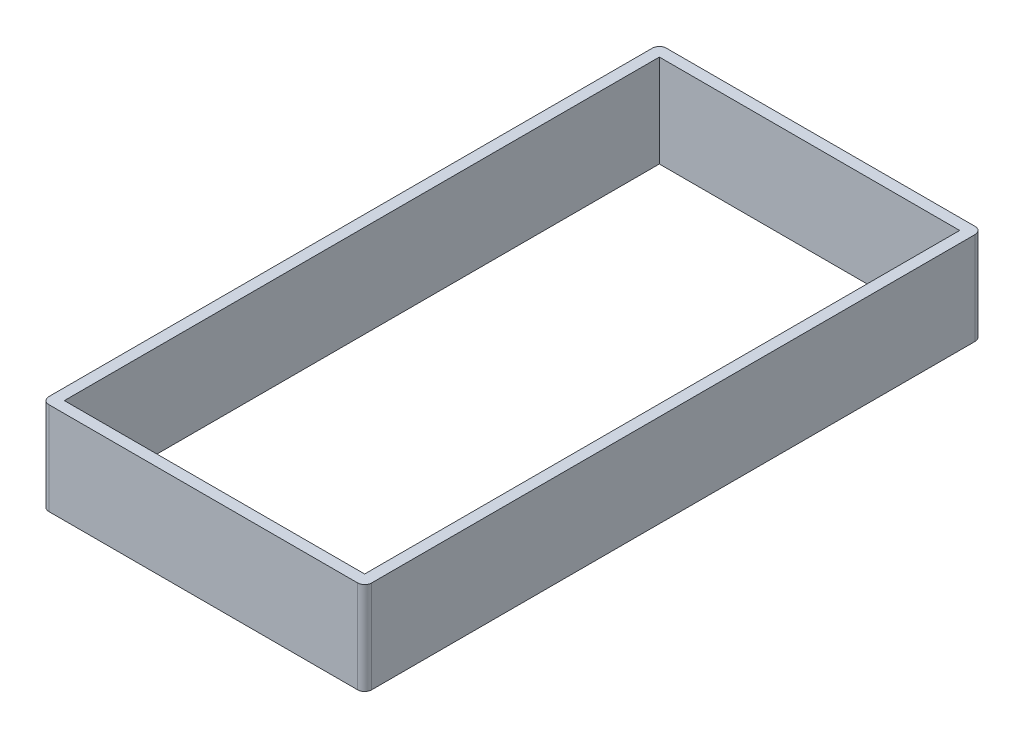
ISO-10303-21;
HEADER;
FILE_DESCRIPTION(('STEP AP214'),'2;1');
FILE_NAME('part.step','',(''),(''),'','','');
FILE_SCHEMA(('AUTOMOTIVE_DESIGN { 1 0 10303 214 1 1 1 1 }'));
ENDSEC;
DATA;
#1=APPLICATION_CONTEXT('core data for automotive mechanical design processes');
#2=APPLICATION_PROTOCOL_DEFINITION('international standard','automotive_design',2000,#1);
#3=PRODUCT_CONTEXT('',#1,'mechanical');
#4=PRODUCT('Part','Part','',(#3));
#5=PRODUCT_RELATED_PRODUCT_CATEGORY('part','',(#4));
#6=PRODUCT_DEFINITION_FORMATION('','',#4);
#7=PRODUCT_DEFINITION_CONTEXT('part definition',#1,'design');
#8=PRODUCT_DEFINITION('design','',#6,#7);
#9=PRODUCT_DEFINITION_SHAPE('','',#8);
#10=(LENGTH_UNIT() NAMED_UNIT(*) SI_UNIT(.MILLI.,.METRE.));
#11=(NAMED_UNIT(*) PLANE_ANGLE_UNIT() SI_UNIT($,.RADIAN.));
#12=(NAMED_UNIT(*) SI_UNIT($,.STERADIAN.) SOLID_ANGLE_UNIT());
#13=UNCERTAINTY_MEASURE_WITH_UNIT(LENGTH_MEASURE(1.E-05),#10,'distance_accuracy_value','');
#14=(GEOMETRIC_REPRESENTATION_CONTEXT(3) GLOBAL_UNCERTAINTY_ASSIGNED_CONTEXT((#13)) GLOBAL_UNIT_ASSIGNED_CONTEXT((#10,
#11,#12)) REPRESENTATION_CONTEXT('',''));
#15=CARTESIAN_POINT('',(0.,0.,0.));
#16=DIRECTION('',(0.,0.,1.));
#17=DIRECTION('',(1.,0.,0.));
#18=AXIS2_PLACEMENT_3D('',#15,#16,#17);
#19=CARTESIAN_POINT('',(11.5,3.3,-22.));
#20=DIRECTION('',(-1.,0.,0.));
#21=DIRECTION('',(0.,0.,1.));
#22=AXIS2_PLACEMENT_3D('',#19,#20,#21);
#23=PLANE('',#22);
#24=DIRECTION('',(0.,0.,-1.));
#25=VECTOR('',#24,1.);
#26=CARTESIAN_POINT('',(11.5,-3.3,-22.));
#27=LINE('',#26,#25);
#28=CARTESIAN_POINT('',(11.5,-3.3,21.5));
#29=VERTEX_POINT('',#28);
#30=CARTESIAN_POINT('',(11.5,-3.3,-21.5));
#31=VERTEX_POINT('',#30);
#32=EDGE_CURVE('E160',#29,#31,#27,.T.);
#33=ORIENTED_EDGE('',*,*,#32,.T.);
#34=DIRECTION('',(0.,-1.,0.));
#35=VECTOR('',#34,1.);
#36=CARTESIAN_POINT('',(11.5,3.3,-21.5));
#37=LINE('',#36,#35);
#38=CARTESIAN_POINT('',(11.5,3.3,-21.5));
#39=VERTEX_POINT('',#38);
#40=EDGE_CURVE('E218',#31,#39,#37,.F.);
#41=ORIENTED_EDGE('',*,*,#40,.T.);
#42=DIRECTION('',(0.,0.,-1.));
#43=VECTOR('',#42,1.);
#44=CARTESIAN_POINT('',(11.5,3.3,-22.));
#45=LINE('',#44,#43);
#46=CARTESIAN_POINT('',(11.5,3.3,21.5));
#47=VERTEX_POINT('',#46);
#48=EDGE_CURVE('E164',#47,#39,#45,.T.);
#49=ORIENTED_EDGE('',*,*,#48,.F.);
#50=DIRECTION('',(0.,-1.,0.));
#51=VECTOR('',#50,1.);
#52=CARTESIAN_POINT('',(11.5,3.3,21.5));
#53=LINE('',#52,#51);
#54=EDGE_CURVE('E215',#47,#29,#53,.T.);
#55=ORIENTED_EDGE('',*,*,#54,.T.);
#56=EDGE_LOOP('',(#33,#41,#49,#55));
#57=FACE_BOUND('',#56,.T.);
#58=ADVANCED_FACE('F37',(#57),#23,.F.);
#59=CARTESIAN_POINT('',(-11.5,3.3,-22.));
#60=DIRECTION('',(0.,0.,1.));
#61=DIRECTION('',(1.,0.,0.));
#62=AXIS2_PLACEMENT_3D('',#59,#60,#61);
#63=PLANE('',#62);
#64=DIRECTION('',(-1.,0.,0.));
#65=VECTOR('',#64,1.);
#66=CARTESIAN_POINT('',(-11.5,-3.3,-22.));
#67=LINE('',#66,#65);
#68=CARTESIAN_POINT('',(11.,-3.3,-22.));
#69=VERTEX_POINT('',#68);
#70=CARTESIAN_POINT('',(-11.,-3.3,-22.));
#71=VERTEX_POINT('',#70);
#72=EDGE_CURVE('E181',#69,#71,#67,.T.);
#73=ORIENTED_EDGE('',*,*,#72,.T.);
#74=DIRECTION('',(0.,-1.,0.));
#75=VECTOR('',#74,1.);
#76=CARTESIAN_POINT('',(-11.,3.3,-22.));
#77=LINE('',#76,#75);
#78=CARTESIAN_POINT('',(-11.,3.3,-22.));
#79=VERTEX_POINT('',#78);
#80=EDGE_CURVE('E205',#71,#79,#77,.F.);
#81=ORIENTED_EDGE('',*,*,#80,.T.);
#82=DIRECTION('',(-1.,0.,0.));
#83=VECTOR('',#82,1.);
#84=CARTESIAN_POINT('',(-11.5,3.3,-22.));
#85=LINE('',#84,#83);
#86=CARTESIAN_POINT('',(11.,3.3,-22.));
#87=VERTEX_POINT('',#86);
#88=EDGE_CURVE('E167',#87,#79,#85,.T.);
#89=ORIENTED_EDGE('',*,*,#88,.F.);
#90=DIRECTION('',(0.,-1.,0.));
#91=VECTOR('',#90,1.);
#92=CARTESIAN_POINT('',(11.,3.3,-22.));
#93=LINE('',#92,#91);
#94=EDGE_CURVE('E202',#87,#69,#93,.T.);
#95=ORIENTED_EDGE('',*,*,#94,.T.);
#96=EDGE_LOOP('',(#73,#81,#89,#95));
#97=FACE_BOUND('',#96,.T.);
#98=ADVANCED_FACE('F246',(#97),#63,.F.);
#99=CARTESIAN_POINT('',(-11.5,3.3,-22.));
#100=DIRECTION('',(1.,0.,0.));
#101=DIRECTION('',(0.,0.,-1.));
#102=AXIS2_PLACEMENT_3D('',#99,#100,#101);
#103=PLANE('',#102);
#104=DIRECTION('',(0.,0.,1.));
#105=VECTOR('',#104,1.);
#106=CARTESIAN_POINT('',(-11.5,3.3,-22.));
#107=LINE('',#106,#105);
#108=CARTESIAN_POINT('',(-11.5,3.3,-21.5));
#109=VERTEX_POINT('',#108);
#110=CARTESIAN_POINT('',(-11.5,3.3,21.5));
#111=VERTEX_POINT('',#110);
#112=EDGE_CURVE('E171',#109,#111,#107,.T.);
#113=ORIENTED_EDGE('',*,*,#112,.F.);
#114=DIRECTION('',(0.,-1.,0.));
#115=VECTOR('',#114,1.);
#116=CARTESIAN_POINT('',(-11.5,3.3,-21.5));
#117=LINE('',#116,#115);
#118=CARTESIAN_POINT('',(-11.5,-3.3,-21.5));
#119=VERTEX_POINT('',#118);
#120=EDGE_CURVE('E191',#109,#119,#117,.T.);
#121=ORIENTED_EDGE('',*,*,#120,.T.);
#122=DIRECTION('',(0.,0.,1.));
#123=VECTOR('',#122,1.);
#124=CARTESIAN_POINT('',(-11.5,-3.3,-22.));
#125=LINE('',#124,#123);
#126=CARTESIAN_POINT('',(-11.5,-3.3,21.5));
#127=VERTEX_POINT('',#126);
#128=EDGE_CURVE('E184',#119,#127,#125,.T.);
#129=ORIENTED_EDGE('',*,*,#128,.T.);
#130=DIRECTION('',(0.,-1.,0.));
#131=VECTOR('',#130,1.);
#132=CARTESIAN_POINT('',(-11.5,3.3,21.5));
#133=LINE('',#132,#131);
#134=EDGE_CURVE('E178',#127,#111,#133,.F.);
#135=ORIENTED_EDGE('',*,*,#134,.T.);
#136=EDGE_LOOP('',(#113,#121,#129,#135));
#137=FACE_BOUND('',#136,.T.);
#138=ADVANCED_FACE('F254',(#137),#103,.F.);
#139=CARTESIAN_POINT('',(-11.5,3.3,22.));
#140=DIRECTION('',(0.,0.,-1.));
#141=DIRECTION('',(-1.,0.,0.));
#142=AXIS2_PLACEMENT_3D('',#139,#140,#141);
#143=PLANE('',#142);
#144=DIRECTION('',(1.,0.,0.));
#145=VECTOR('',#144,1.);
#146=CARTESIAN_POINT('',(-11.5,-3.3,22.));
#147=LINE('',#146,#145);
#148=CARTESIAN_POINT('',(-11.,-3.3,22.));
#149=VERTEX_POINT('',#148);
#150=CARTESIAN_POINT('',(11.,-3.3,22.));
#151=VERTEX_POINT('',#150);
#152=EDGE_CURVE('E168',#149,#151,#147,.T.);
#153=ORIENTED_EDGE('',*,*,#152,.T.);
#154=DIRECTION('',(0.,-1.,0.));
#155=VECTOR('',#154,1.);
#156=CARTESIAN_POINT('',(11.,3.3,22.));
#157=LINE('',#156,#155);
#158=CARTESIAN_POINT('',(11.,3.3,22.));
#159=VERTEX_POINT('',#158);
#160=EDGE_CURVE('E11',#151,#159,#157,.F.);
#161=ORIENTED_EDGE('',*,*,#160,.T.);
#162=DIRECTION('',(1.,0.,0.));
#163=VECTOR('',#162,1.);
#164=CARTESIAN_POINT('',(-11.5,3.3,22.));
#165=LINE('',#164,#163);
#166=CARTESIAN_POINT('',(-11.,3.3,22.));
#167=VERTEX_POINT('',#166);
#168=EDGE_CURVE('E174',#167,#159,#165,.T.);
#169=ORIENTED_EDGE('',*,*,#168,.F.);
#170=DIRECTION('',(0.,-1.,0.));
#171=VECTOR('',#170,1.);
#172=CARTESIAN_POINT('',(-11.,3.3,22.));
#173=LINE('',#172,#171);
#174=EDGE_CURVE('E45',#167,#149,#173,.T.);
#175=ORIENTED_EDGE('',*,*,#174,.T.);
#176=EDGE_LOOP('',(#153,#161,#169,#175));
#177=FACE_BOUND('',#176,.T.);
#178=ADVANCED_FACE('F224',(#177),#143,.F.);
#179=CARTESIAN_POINT('',(0.,3.3,0.));
#180=DIRECTION('',(0.,1.,0.));
#181=DIRECTION('',(0.,0.,1.));
#182=AXIS2_PLACEMENT_3D('',#179,#180,#181);
#183=PLANE('',#182);
#184=DIRECTION('',(0.,0.,-1.));
#185=VECTOR('',#184,1.);
#186=CARTESIAN_POINT('',(10.7,3.3,21.2));
#187=LINE('',#186,#185);
#188=CARTESIAN_POINT('',(10.7,3.3,21.2));
#189=VERTEX_POINT('',#188);
#190=CARTESIAN_POINT('',(10.7,3.3,-21.2));
#191=VERTEX_POINT('',#190);
#192=EDGE_CURVE('E52',#189,#191,#187,.T.);
#193=ORIENTED_EDGE('',*,*,#192,.F.);
#194=DIRECTION('',(1.,0.,0.));
#195=VECTOR('',#194,1.);
#196=CARTESIAN_POINT('',(-10.7,3.3,21.2));
#197=LINE('',#196,#195);
#198=CARTESIAN_POINT('',(-10.7,3.3,21.2));
#199=VERTEX_POINT('',#198);
#200=EDGE_CURVE('E143',#199,#189,#197,.T.);
#201=ORIENTED_EDGE('',*,*,#200,.F.);
#202=DIRECTION('',(0.,0.,1.));
#203=VECTOR('',#202,1.);
#204=CARTESIAN_POINT('',(-10.7,3.3,-21.2));
#205=LINE('',#204,#203);
#206=CARTESIAN_POINT('',(-10.7,3.3,-21.2));
#207=VERTEX_POINT('',#206);
#208=EDGE_CURVE('E147',#207,#199,#205,.T.);
#209=ORIENTED_EDGE('',*,*,#208,.F.);
#210=DIRECTION('',(-1.,0.,0.));
#211=VECTOR('',#210,1.);
#212=CARTESIAN_POINT('',(10.7,3.3,-21.2));
#213=LINE('',#212,#211);
#214=EDGE_CURVE('E154',#191,#207,#213,.T.);
#215=ORIENTED_EDGE('',*,*,#214,.F.);
#216=EDGE_LOOP('',(#193,#201,#209,#215));
#217=FACE_BOUND('',#216,.T.);
#218=ORIENTED_EDGE('',*,*,#88,.T.);
#219=CARTESIAN_POINT('',(-11.,3.3,-21.5));
#220=DIRECTION('',(0.,1.,0.));
#221=DIRECTION('',(0.,0.,1.));
#222=AXIS2_PLACEMENT_3D('',#219,#220,#221);
#223=CIRCLE('',#222,0.5);
#224=EDGE_CURVE('E213',#79,#109,#223,.T.);
#225=ORIENTED_EDGE('',*,*,#224,.T.);
#226=ORIENTED_EDGE('',*,*,#112,.T.);
#227=CARTESIAN_POINT('',(-11.,3.3,21.5));
#228=DIRECTION('',(0.,1.,0.));
#229=DIRECTION('',(0.,0.,1.));
#230=AXIS2_PLACEMENT_3D('',#227,#228,#229);
#231=CIRCLE('',#230,0.5);
#232=EDGE_CURVE('E207',#111,#167,#231,.T.);
#233=ORIENTED_EDGE('',*,*,#232,.T.);
#234=ORIENTED_EDGE('',*,*,#168,.T.);
#235=CARTESIAN_POINT('',(11.,3.3,21.5));
#236=DIRECTION('',(0.,1.,0.));
#237=DIRECTION('',(0.,0.,1.));
#238=AXIS2_PLACEMENT_3D('',#235,#236,#237);
#239=CIRCLE('',#238,0.5);
#240=EDGE_CURVE('E209',#159,#47,#239,.T.);
#241=ORIENTED_EDGE('',*,*,#240,.T.);
#242=ORIENTED_EDGE('',*,*,#48,.T.);
#243=CARTESIAN_POINT('',(11.,3.3,-21.5));
#244=DIRECTION('',(0.,1.,0.));
#245=DIRECTION('',(0.,0.,1.));
#246=AXIS2_PLACEMENT_3D('',#243,#244,#245);
#247=CIRCLE('',#246,0.5);
#248=EDGE_CURVE('E211',#39,#87,#247,.T.);
#249=ORIENTED_EDGE('',*,*,#248,.T.);
#250=EDGE_LOOP('',(#218,#225,#226,#233,#234,#241,#242,#249));
#251=FACE_BOUND('',#250,.T.);
#252=ADVANCED_FACE('F239',(#217,#251),#183,.T.);
#253=CARTESIAN_POINT('',(0.,-3.3,0.));
#254=DIRECTION('',(0.,1.,0.));
#255=DIRECTION('',(0.,0.,1.));
#256=AXIS2_PLACEMENT_3D('',#253,#254,#255);
#257=PLANE('',#256);
#258=DIRECTION('',(1.,0.,0.));
#259=VECTOR('',#258,1.);
#260=CARTESIAN_POINT('',(-10.7,-3.3,21.2));
#261=LINE('',#260,#259);
#262=CARTESIAN_POINT('',(-10.7,-3.3,21.2));
#263=VERTEX_POINT('',#262);
#264=CARTESIAN_POINT('',(10.7,-3.3,21.2));
#265=VERTEX_POINT('',#264);
#266=EDGE_CURVE('E133',#263,#265,#261,.T.);
#267=ORIENTED_EDGE('',*,*,#266,.T.);
#268=DIRECTION('',(0.,0.,-1.));
#269=VECTOR('',#268,1.);
#270=CARTESIAN_POINT('',(10.7,-3.3,21.2));
#271=LINE('',#270,#269);
#272=CARTESIAN_POINT('',(10.7,-3.3,-21.2));
#273=VERTEX_POINT('',#272);
#274=EDGE_CURVE('E127',#265,#273,#271,.T.);
#275=ORIENTED_EDGE('',*,*,#274,.T.);
#276=DIRECTION('',(-1.,0.,0.));
#277=VECTOR('',#276,1.);
#278=CARTESIAN_POINT('',(10.7,-3.3,-21.2));
#279=LINE('',#278,#277);
#280=CARTESIAN_POINT('',(-10.7,-3.3,-21.2));
#281=VERTEX_POINT('',#280);
#282=EDGE_CURVE('E136',#273,#281,#279,.T.);
#283=ORIENTED_EDGE('',*,*,#282,.T.);
#284=DIRECTION('',(0.,0.,1.));
#285=VECTOR('',#284,1.);
#286=CARTESIAN_POINT('',(-10.7,-3.3,-21.2));
#287=LINE('',#286,#285);
#288=EDGE_CURVE('E60',#281,#263,#287,.T.);
#289=ORIENTED_EDGE('',*,*,#288,.T.);
#290=EDGE_LOOP('',(#267,#275,#283,#289));
#291=FACE_BOUND('',#290,.T.);
#292=ORIENTED_EDGE('',*,*,#128,.F.);
#293=CARTESIAN_POINT('',(-11.,-3.3,-21.5));
#294=DIRECTION('',(0.,1.,0.));
#295=DIRECTION('',(0.,0.,1.));
#296=AXIS2_PLACEMENT_3D('',#293,#294,#295);
#297=CIRCLE('',#296,0.5);
#298=EDGE_CURVE('E200',#119,#71,#297,.F.);
#299=ORIENTED_EDGE('',*,*,#298,.T.);
#300=ORIENTED_EDGE('',*,*,#72,.F.);
#301=CARTESIAN_POINT('',(11.,-3.3,-21.5));
#302=DIRECTION('',(0.,1.,0.));
#303=DIRECTION('',(0.,0.,1.));
#304=AXIS2_PLACEMENT_3D('',#301,#302,#303);
#305=CIRCLE('',#304,0.5);
#306=EDGE_CURVE('E198',#69,#31,#305,.F.);
#307=ORIENTED_EDGE('',*,*,#306,.T.);
#308=ORIENTED_EDGE('',*,*,#32,.F.);
#309=CARTESIAN_POINT('',(11.,-3.3,21.5));
#310=DIRECTION('',(0.,1.,0.));
#311=DIRECTION('',(0.,0.,1.));
#312=AXIS2_PLACEMENT_3D('',#309,#310,#311);
#313=CIRCLE('',#312,0.5);
#314=EDGE_CURVE('E196',#29,#151,#313,.F.);
#315=ORIENTED_EDGE('',*,*,#314,.T.);
#316=ORIENTED_EDGE('',*,*,#152,.F.);
#317=CARTESIAN_POINT('',(-11.,-3.3,21.5));
#318=DIRECTION('',(0.,1.,0.));
#319=DIRECTION('',(0.,0.,1.));
#320=AXIS2_PLACEMENT_3D('',#317,#318,#319);
#321=CIRCLE('',#320,0.5);
#322=EDGE_CURVE('E194',#149,#127,#321,.F.);
#323=ORIENTED_EDGE('',*,*,#322,.T.);
#324=EDGE_LOOP('',(#292,#299,#300,#307,#308,#315,#316,#323));
#325=FACE_BOUND('',#324,.T.);
#326=ADVANCED_FACE('F140',(#291,#325),#257,.F.);
#327=CARTESIAN_POINT('',(-11.,3.3,-21.5));
#328=DIRECTION('',(0.,-1.,0.));
#329=DIRECTION('',(0.,0.,-1.));
#330=AXIS2_PLACEMENT_3D('',#327,#328,#329);
#331=CYLINDRICAL_SURFACE('',#330,0.5);
#332=ORIENTED_EDGE('',*,*,#224,.F.);
#333=ORIENTED_EDGE('',*,*,#80,.F.);
#334=ORIENTED_EDGE('',*,*,#298,.F.);
#335=ORIENTED_EDGE('',*,*,#120,.F.);
#336=EDGE_LOOP('',(#332,#333,#334,#335));
#337=FACE_BOUND('',#336,.T.);
#338=ADVANCED_FACE('F251',(#337),#331,.T.);
#339=CARTESIAN_POINT('',(11.,3.3,-21.5));
#340=DIRECTION('',(0.,-1.,0.));
#341=DIRECTION('',(0.,0.,-1.));
#342=AXIS2_PLACEMENT_3D('',#339,#340,#341);
#343=CYLINDRICAL_SURFACE('',#342,0.5);
#344=ORIENTED_EDGE('',*,*,#248,.F.);
#345=ORIENTED_EDGE('',*,*,#40,.F.);
#346=ORIENTED_EDGE('',*,*,#306,.F.);
#347=ORIENTED_EDGE('',*,*,#94,.F.);
#348=EDGE_LOOP('',(#344,#345,#346,#347));
#349=FACE_BOUND('',#348,.T.);
#350=ADVANCED_FACE('F243',(#349),#343,.T.);
#351=CARTESIAN_POINT('',(11.,3.3,21.5));
#352=DIRECTION('',(0.,-1.,0.));
#353=DIRECTION('',(0.,0.,-1.));
#354=AXIS2_PLACEMENT_3D('',#351,#352,#353);
#355=CYLINDRICAL_SURFACE('',#354,0.5);
#356=ORIENTED_EDGE('',*,*,#240,.F.);
#357=ORIENTED_EDGE('',*,*,#160,.F.);
#358=ORIENTED_EDGE('',*,*,#314,.F.);
#359=ORIENTED_EDGE('',*,*,#54,.F.);
#360=EDGE_LOOP('',(#356,#357,#358,#359));
#361=FACE_BOUND('',#360,.T.);
#362=ADVANCED_FACE('F233',(#361),#355,.T.);
#363=CARTESIAN_POINT('',(-11.,3.3,21.5));
#364=DIRECTION('',(0.,-1.,0.));
#365=DIRECTION('',(0.,0.,-1.));
#366=AXIS2_PLACEMENT_3D('',#363,#364,#365);
#367=CYLINDRICAL_SURFACE('',#366,0.5);
#368=ORIENTED_EDGE('',*,*,#232,.F.);
#369=ORIENTED_EDGE('',*,*,#134,.F.);
#370=ORIENTED_EDGE('',*,*,#322,.F.);
#371=ORIENTED_EDGE('',*,*,#174,.F.);
#372=EDGE_LOOP('',(#368,#369,#370,#371));
#373=FACE_BOUND('',#372,.T.);
#374=ADVANCED_FACE('F39',(#373),#367,.T.);
#375=CARTESIAN_POINT('',(10.7,-3.3,21.2));
#376=DIRECTION('',(1.,0.,0.));
#377=DIRECTION('',(0.,0.,-1.));
#378=AXIS2_PLACEMENT_3D('',#375,#376,#377);
#379=PLANE('',#378);
#380=ORIENTED_EDGE('',*,*,#192,.T.);
#381=DIRECTION('',(0.,1.,0.));
#382=VECTOR('',#381,1.);
#383=CARTESIAN_POINT('',(10.7,-3.3,-21.2));
#384=LINE('',#383,#382);
#385=EDGE_CURVE('E123',#273,#191,#384,.T.);
#386=ORIENTED_EDGE('',*,*,#385,.F.);
#387=ORIENTED_EDGE('',*,*,#274,.F.);
#388=DIRECTION('',(0.,1.,0.));
#389=VECTOR('',#388,1.);
#390=CARTESIAN_POINT('',(10.7,-3.3,21.2));
#391=LINE('',#390,#389);
#392=EDGE_CURVE('E158',#265,#189,#391,.T.);
#393=ORIENTED_EDGE('',*,*,#392,.T.);
#394=EDGE_LOOP('',(#380,#386,#387,#393));
#395=FACE_BOUND('',#394,.T.);
#396=ADVANCED_FACE('F125',(#395),#379,.F.);
#397=CARTESIAN_POINT('',(-10.7,-3.3,21.2));
#398=DIRECTION('',(0.,0.,1.));
#399=DIRECTION('',(1.,0.,0.));
#400=AXIS2_PLACEMENT_3D('',#397,#398,#399);
#401=PLANE('',#400);
#402=ORIENTED_EDGE('',*,*,#200,.T.);
#403=ORIENTED_EDGE('',*,*,#392,.F.);
#404=ORIENTED_EDGE('',*,*,#266,.F.);
#405=DIRECTION('',(0.,1.,0.));
#406=VECTOR('',#405,1.);
#407=CARTESIAN_POINT('',(-10.7,-3.3,21.2));
#408=LINE('',#407,#406);
#409=EDGE_CURVE('E161',#263,#199,#408,.T.);
#410=ORIENTED_EDGE('',*,*,#409,.T.);
#411=EDGE_LOOP('',(#402,#403,#404,#410));
#412=FACE_BOUND('',#411,.T.);
#413=ADVANCED_FACE('F261',(#412),#401,.F.);
#414=CARTESIAN_POINT('',(-10.7,-3.3,-21.2));
#415=DIRECTION('',(-1.,0.,0.));
#416=DIRECTION('',(0.,0.,1.));
#417=AXIS2_PLACEMENT_3D('',#414,#415,#416);
#418=PLANE('',#417);
#419=ORIENTED_EDGE('',*,*,#208,.T.);
#420=ORIENTED_EDGE('',*,*,#409,.F.);
#421=ORIENTED_EDGE('',*,*,#288,.F.);
#422=DIRECTION('',(0.,1.,0.));
#423=VECTOR('',#422,1.);
#424=CARTESIAN_POINT('',(-10.7,-3.3,-21.2));
#425=LINE('',#424,#423);
#426=EDGE_CURVE('E132',#281,#207,#425,.T.);
#427=ORIENTED_EDGE('',*,*,#426,.T.);
#428=EDGE_LOOP('',(#419,#420,#421,#427));
#429=FACE_BOUND('',#428,.T.);
#430=ADVANCED_FACE('F322',(#429),#418,.F.);
#431=CARTESIAN_POINT('',(10.7,-3.3,-21.2));
#432=DIRECTION('',(0.,0.,-1.));
#433=DIRECTION('',(-1.,0.,0.));
#434=AXIS2_PLACEMENT_3D('',#431,#432,#433);
#435=PLANE('',#434);
#436=ORIENTED_EDGE('',*,*,#214,.T.);
#437=ORIENTED_EDGE('',*,*,#426,.F.);
#438=ORIENTED_EDGE('',*,*,#282,.F.);
#439=ORIENTED_EDGE('',*,*,#385,.T.);
#440=EDGE_LOOP('',(#436,#437,#438,#439));
#441=FACE_BOUND('',#440,.T.);
#442=ADVANCED_FACE('F137',(#441),#435,.F.);
#443=CLOSED_SHELL('',(#58,#98,#138,#178,#252,#326,#338,#350,#362,#374,#396,#413,#430,#442));
#444=MANIFOLD_SOLID_BREP('B2',#443);
#445=ADVANCED_BREP_SHAPE_REPRESENTATION('',(#18,#444),#14);
#446=SHAPE_DEFINITION_REPRESENTATION(#9,#445);
ENDSEC;
END-ISO-10303-21;
